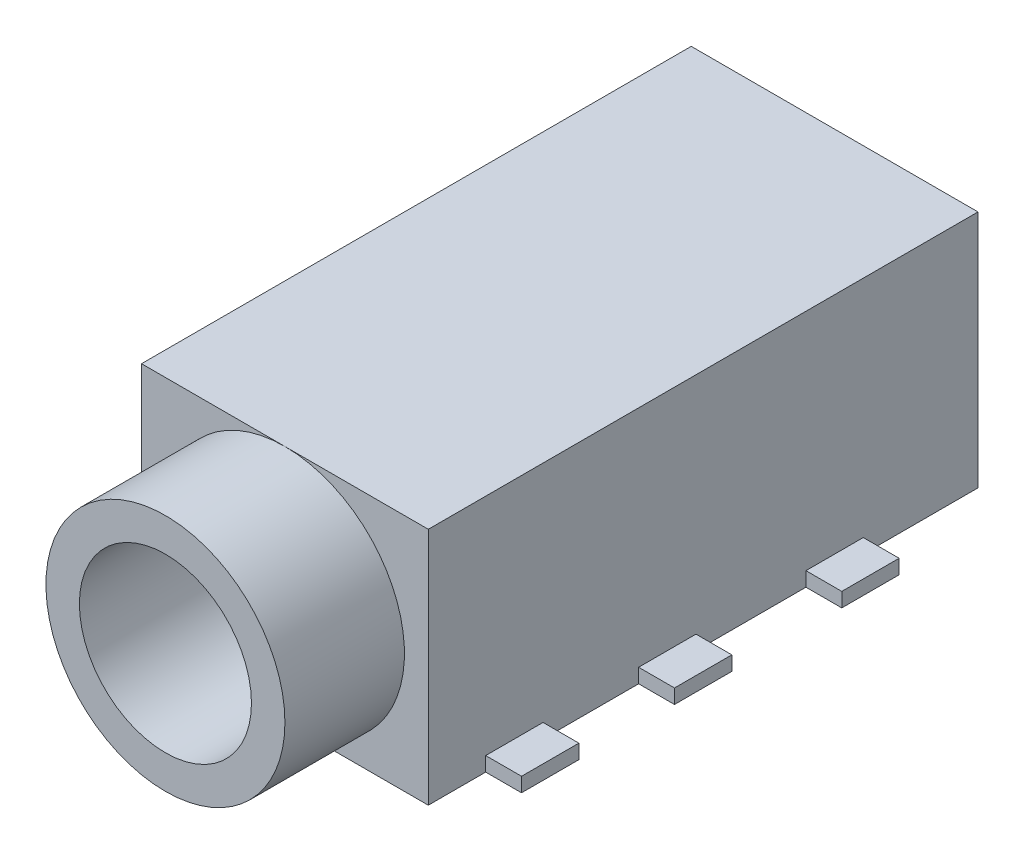
ISO-10303-21;
HEADER;
FILE_DESCRIPTION(('STEP AP214'),'2;1');
FILE_NAME('part.step','',(''),(''),'','','');
FILE_SCHEMA(('AUTOMOTIVE_DESIGN { 1 0 10303 214 1 1 1 1 }'));
ENDSEC;
DATA;
#1=APPLICATION_CONTEXT('core data for automotive mechanical design processes');
#2=APPLICATION_PROTOCOL_DEFINITION('international standard','automotive_design',2000,#1);
#3=PRODUCT_CONTEXT('',#1,'mechanical');
#4=PRODUCT('Part','Part','',(#3));
#5=PRODUCT_RELATED_PRODUCT_CATEGORY('part','',(#4));
#6=PRODUCT_DEFINITION_FORMATION('','',#4);
#7=PRODUCT_DEFINITION_CONTEXT('part definition',#1,'design');
#8=PRODUCT_DEFINITION('design','',#6,#7);
#9=PRODUCT_DEFINITION_SHAPE('','',#8);
#10=(LENGTH_UNIT() NAMED_UNIT(*) SI_UNIT(.MILLI.,.METRE.));
#11=(NAMED_UNIT(*) PLANE_ANGLE_UNIT() SI_UNIT($,.RADIAN.));
#12=(NAMED_UNIT(*) SI_UNIT($,.STERADIAN.) SOLID_ANGLE_UNIT());
#13=UNCERTAINTY_MEASURE_WITH_UNIT(LENGTH_MEASURE(1.E-05),#10,'distance_accuracy_value','');
#14=(GEOMETRIC_REPRESENTATION_CONTEXT(3) GLOBAL_UNCERTAINTY_ASSIGNED_CONTEXT((#13)) GLOBAL_UNIT_ASSIGNED_CONTEXT((#10,
#11,#12)) REPRESENTATION_CONTEXT('',''));
#15=CARTESIAN_POINT('',(0.,0.,0.));
#16=DIRECTION('',(0.,0.,1.));
#17=DIRECTION('',(1.,0.,0.));
#18=AXIS2_PLACEMENT_3D('',#15,#16,#17);
#19=CARTESIAN_POINT('',(-3.,2.5,11.5));
#20=DIRECTION('',(1.,0.,0.));
#21=DIRECTION('',(0.,0.,-1.));
#22=AXIS2_PLACEMENT_3D('',#19,#20,#21);
#23=PLANE('',#22);
#24=DIRECTION('',(0.,0.,1.));
#25=VECTOR('',#24,1.);
#26=CARTESIAN_POINT('',(-3.,-2.2,10.3));
#27=LINE('',#26,#25);
#28=CARTESIAN_POINT('',(-3.,-2.2,9.1));
#29=VERTEX_POINT('',#28);
#30=CARTESIAN_POINT('',(-3.,-2.2,10.3));
#31=VERTEX_POINT('',#30);
#32=EDGE_CURVE('E251',#29,#31,#27,.T.);
#33=ORIENTED_EDGE('',*,*,#32,.T.);
#34=DIRECTION('',(0.,-1.,0.));
#35=VECTOR('',#34,1.);
#36=CARTESIAN_POINT('',(-3.,-2.2,10.3));
#37=LINE('',#36,#35);
#38=CARTESIAN_POINT('',(-3.,-2.5,10.3));
#39=VERTEX_POINT('',#38);
#40=EDGE_CURVE('E265',#31,#39,#37,.T.);
#41=ORIENTED_EDGE('',*,*,#40,.T.);
#42=DIRECTION('',(0.,0.,-1.));
#43=VECTOR('',#42,1.);
#44=CARTESIAN_POINT('',(-3.,-2.5,11.5));
#45=LINE('',#44,#43);
#46=CARTESIAN_POINT('',(-3.,-2.5,11.5));
#47=VERTEX_POINT('',#46);
#48=EDGE_CURVE('E545',#47,#39,#45,.T.);
#49=ORIENTED_EDGE('',*,*,#48,.F.);
#50=DIRECTION('',(0.,-1.,0.));
#51=VECTOR('',#50,1.);
#52=CARTESIAN_POINT('',(-3.,2.5,11.5));
#53=LINE('',#52,#51);
#54=CARTESIAN_POINT('',(-3.,2.5,11.5));
#55=VERTEX_POINT('',#54);
#56=EDGE_CURVE('E517',#55,#47,#53,.T.);
#57=ORIENTED_EDGE('',*,*,#56,.F.);
#58=DIRECTION('',(0.,0.,-1.));
#59=VECTOR('',#58,1.);
#60=CARTESIAN_POINT('',(-3.,2.5,11.5));
#61=LINE('',#60,#59);
#62=CARTESIAN_POINT('',(-3.,2.5,0.));
#63=VERTEX_POINT('',#62);
#64=EDGE_CURVE('E549',#55,#63,#61,.T.);
#65=ORIENTED_EDGE('',*,*,#64,.T.);
#66=DIRECTION('',(0.,-1.,0.));
#67=VECTOR('',#66,1.);
#68=CARTESIAN_POINT('',(-3.,2.5,0.));
#69=LINE('',#68,#67);
#70=CARTESIAN_POINT('',(-3.,-2.5,0.));
#71=VERTEX_POINT('',#70);
#72=EDGE_CURVE('E532',#63,#71,#69,.T.);
#73=ORIENTED_EDGE('',*,*,#72,.T.);
#74=CARTESIAN_POINT('',(-3.,-2.5,2.40000000000001));
#75=VERTEX_POINT('',#74);
#76=EDGE_CURVE('E543',#75,#71,#45,.T.);
#77=ORIENTED_EDGE('',*,*,#76,.F.);
#78=DIRECTION('',(0.,-1.,0.));
#79=VECTOR('',#78,1.);
#80=CARTESIAN_POINT('',(-3.,-2.2,2.40000000000001));
#81=LINE('',#80,#79);
#82=CARTESIAN_POINT('',(-3.,-2.2,2.40000000000001));
#83=VERTEX_POINT('',#82);
#84=EDGE_CURVE('E361',#83,#75,#81,.T.);
#85=ORIENTED_EDGE('',*,*,#84,.F.);
#86=DIRECTION('',(0.,0.,1.));
#87=VECTOR('',#86,1.);
#88=CARTESIAN_POINT('',(-3.,-2.2,3.6));
#89=LINE('',#88,#87);
#90=CARTESIAN_POINT('',(-3.,-2.2,3.6));
#91=VERTEX_POINT('',#90);
#92=EDGE_CURVE('E341',#83,#91,#89,.T.);
#93=ORIENTED_EDGE('',*,*,#92,.T.);
#94=DIRECTION('',(0.,-1.,0.));
#95=VECTOR('',#94,1.);
#96=CARTESIAN_POINT('',(-3.,-2.2,3.6));
#97=LINE('',#96,#95);
#98=CARTESIAN_POINT('',(-3.,-2.5,3.60000000000001));
#99=VERTEX_POINT('',#98);
#100=EDGE_CURVE('E356',#91,#99,#97,.T.);
#101=ORIENTED_EDGE('',*,*,#100,.T.);
#102=CARTESIAN_POINT('',(-3.,-2.5,5.9));
#103=VERTEX_POINT('',#102);
#104=EDGE_CURVE('E622',#103,#99,#45,.T.);
#105=ORIENTED_EDGE('',*,*,#104,.F.);
#106=DIRECTION('',(0.,-1.,0.));
#107=VECTOR('',#106,1.);
#108=CARTESIAN_POINT('',(-3.,-2.2,5.9));
#109=LINE('',#108,#107);
#110=CARTESIAN_POINT('',(-3.,-2.2,5.9));
#111=VERTEX_POINT('',#110);
#112=EDGE_CURVE('E321',#111,#103,#109,.T.);
#113=ORIENTED_EDGE('',*,*,#112,.F.);
#114=DIRECTION('',(0.,0.,1.));
#115=VECTOR('',#114,1.);
#116=CARTESIAN_POINT('',(-3.,-2.2,7.1));
#117=LINE('',#116,#115);
#118=CARTESIAN_POINT('',(-3.,-2.2,7.1));
#119=VERTEX_POINT('',#118);
#120=EDGE_CURVE('E303',#111,#119,#117,.T.);
#121=ORIENTED_EDGE('',*,*,#120,.T.);
#122=DIRECTION('',(0.,-1.,0.));
#123=VECTOR('',#122,1.);
#124=CARTESIAN_POINT('',(-3.,-2.2,7.1));
#125=LINE('',#124,#123);
#126=CARTESIAN_POINT('',(-3.,-2.5,7.1));
#127=VERTEX_POINT('',#126);
#128=EDGE_CURVE('E316',#119,#127,#125,.T.);
#129=ORIENTED_EDGE('',*,*,#128,.T.);
#130=CARTESIAN_POINT('',(-3.,-2.5,9.1));
#131=VERTEX_POINT('',#130);
#132=EDGE_CURVE('E550',#131,#127,#45,.T.);
#133=ORIENTED_EDGE('',*,*,#132,.F.);
#134=DIRECTION('',(0.,-1.,0.));
#135=VECTOR('',#134,1.);
#136=CARTESIAN_POINT('',(-3.,-2.2,9.1));
#137=LINE('',#136,#135);
#138=EDGE_CURVE('E288',#29,#131,#137,.T.);
#139=ORIENTED_EDGE('',*,*,#138,.F.);
#140=EDGE_LOOP('',(#33,#41,#49,#57,#65,#73,#77,#85,#93,#101,#105,#113,#121,#129,#133,#139));
#141=FACE_BOUND('',#140,.T.);
#142=ADVANCED_FACE('F48',(#141),#23,.F.);
#143=CARTESIAN_POINT('',(3.,2.5,11.5));
#144=DIRECTION('',(-1.,0.,0.));
#145=DIRECTION('',(0.,-1.,0.));
#146=AXIS2_PLACEMENT_3D('',#143,#144,#145);
#147=PLANE('',#146);
#148=DIRECTION('',(0.,0.,-1.));
#149=VECTOR('',#148,1.);
#150=CARTESIAN_POINT('',(3.,-2.5,11.5));
#151=LINE('',#150,#149);
#152=CARTESIAN_POINT('',(3.,-2.5,5.9));
#153=VERTEX_POINT('',#152);
#154=CARTESIAN_POINT('',(3.,-2.5,3.6));
#155=VERTEX_POINT('',#154);
#156=EDGE_CURVE('E1048',#153,#155,#151,.T.);
#157=ORIENTED_EDGE('',*,*,#156,.T.);
#158=DIRECTION('',(0.,-1.,0.));
#159=VECTOR('',#158,1.);
#160=CARTESIAN_POINT('',(3.,-2.2,3.6));
#161=LINE('',#160,#159);
#162=CARTESIAN_POINT('',(3.,-2.2,3.6));
#163=VERTEX_POINT('',#162);
#164=EDGE_CURVE('E396',#163,#155,#161,.T.);
#165=ORIENTED_EDGE('',*,*,#164,.F.);
#166=DIRECTION('',(0.,0.,-1.));
#167=VECTOR('',#166,1.);
#168=CARTESIAN_POINT('',(3.,-2.2,3.6));
#169=LINE('',#168,#167);
#170=CARTESIAN_POINT('',(3.,-2.2,2.4));
#171=VERTEX_POINT('',#170);
#172=EDGE_CURVE('E369',#163,#171,#169,.T.);
#173=ORIENTED_EDGE('',*,*,#172,.T.);
#174=DIRECTION('',(0.,-1.,0.));
#175=VECTOR('',#174,1.);
#176=CARTESIAN_POINT('',(3.,-2.2,2.4));
#177=LINE('',#176,#175);
#178=CARTESIAN_POINT('',(3.,-2.5,2.4));
#179=VERTEX_POINT('',#178);
#180=EDGE_CURVE('E385',#171,#179,#177,.T.);
#181=ORIENTED_EDGE('',*,*,#180,.T.);
#182=CARTESIAN_POINT('',(3.,-2.5,0.));
#183=VERTEX_POINT('',#182);
#184=EDGE_CURVE('E525',#179,#183,#151,.T.);
#185=ORIENTED_EDGE('',*,*,#184,.T.);
#186=DIRECTION('',(0.,1.,0.));
#187=VECTOR('',#186,1.);
#188=CARTESIAN_POINT('',(3.,2.5,0.));
#189=LINE('',#188,#187);
#190=CARTESIAN_POINT('',(3.,2.5,0.));
#191=VERTEX_POINT('',#190);
#192=EDGE_CURVE('E503',#183,#191,#189,.T.);
#193=ORIENTED_EDGE('',*,*,#192,.T.);
#194=DIRECTION('',(0.,0.,-1.));
#195=VECTOR('',#194,1.);
#196=CARTESIAN_POINT('',(3.,2.5,11.5));
#197=LINE('',#196,#195);
#198=CARTESIAN_POINT('',(3.,2.5,11.5));
#199=VERTEX_POINT('',#198);
#200=EDGE_CURVE('E554',#199,#191,#197,.T.);
#201=ORIENTED_EDGE('',*,*,#200,.F.);
#202=DIRECTION('',(0.,1.,0.));
#203=VECTOR('',#202,1.);
#204=CARTESIAN_POINT('',(3.,2.5,11.5));
#205=LINE('',#204,#203);
#206=CARTESIAN_POINT('',(3.,-2.5,11.5));
#207=VERTEX_POINT('',#206);
#208=EDGE_CURVE('E508',#207,#199,#205,.T.);
#209=ORIENTED_EDGE('',*,*,#208,.F.);
#210=CARTESIAN_POINT('',(3.,-2.5,10.3));
#211=VERTEX_POINT('',#210);
#212=EDGE_CURVE('E539',#207,#211,#151,.T.);
#213=ORIENTED_EDGE('',*,*,#212,.T.);
#214=DIRECTION('',(0.,-1.,0.));
#215=VECTOR('',#214,1.);
#216=CARTESIAN_POINT('',(3.,-2.2,10.3));
#217=LINE('',#216,#215);
#218=CARTESIAN_POINT('',(3.,-2.2,10.3));
#219=VERTEX_POINT('',#218);
#220=EDGE_CURVE('E478',#219,#211,#217,.T.);
#221=ORIENTED_EDGE('',*,*,#220,.F.);
#222=DIRECTION('',(0.,0.,-1.));
#223=VECTOR('',#222,1.);
#224=CARTESIAN_POINT('',(3.,-2.2,10.3));
#225=LINE('',#224,#223);
#226=CARTESIAN_POINT('',(3.,-2.2,9.1));
#227=VERTEX_POINT('',#226);
#228=EDGE_CURVE('E450',#219,#227,#225,.T.);
#229=ORIENTED_EDGE('',*,*,#228,.T.);
#230=DIRECTION('',(0.,-1.,0.));
#231=VECTOR('',#230,1.);
#232=CARTESIAN_POINT('',(3.,-2.2,9.1));
#233=LINE('',#232,#231);
#234=CARTESIAN_POINT('',(3.,-2.5,9.1));
#235=VERTEX_POINT('',#234);
#236=EDGE_CURVE('E467',#227,#235,#233,.T.);
#237=ORIENTED_EDGE('',*,*,#236,.T.);
#238=CARTESIAN_POINT('',(3.,-2.5,7.1));
#239=VERTEX_POINT('',#238);
#240=EDGE_CURVE('E544',#235,#239,#151,.T.);
#241=ORIENTED_EDGE('',*,*,#240,.T.);
#242=DIRECTION('',(0.,-1.,0.));
#243=VECTOR('',#242,1.);
#244=CARTESIAN_POINT('',(3.,-2.2,7.1));
#245=LINE('',#244,#243);
#246=CARTESIAN_POINT('',(3.,-2.2,7.1));
#247=VERTEX_POINT('',#246);
#248=EDGE_CURVE('E436',#247,#239,#245,.T.);
#249=ORIENTED_EDGE('',*,*,#248,.F.);
#250=DIRECTION('',(0.,0.,-1.));
#251=VECTOR('',#250,1.);
#252=CARTESIAN_POINT('',(3.,-2.2,7.1));
#253=LINE('',#252,#251);
#254=CARTESIAN_POINT('',(3.,-2.2,5.9));
#255=VERTEX_POINT('',#254);
#256=EDGE_CURVE('E409',#247,#255,#253,.T.);
#257=ORIENTED_EDGE('',*,*,#256,.T.);
#258=DIRECTION('',(0.,-1.,0.));
#259=VECTOR('',#258,1.);
#260=CARTESIAN_POINT('',(3.,-2.2,5.9));
#261=LINE('',#260,#259);
#262=EDGE_CURVE('E425',#255,#153,#261,.T.);
#263=ORIENTED_EDGE('',*,*,#262,.T.);
#264=EDGE_LOOP('',(#157,#165,#173,#181,#185,#193,#201,#209,#213,#221,#229,#237,#241,#249,#257,#263));
#265=FACE_BOUND('',#264,.T.);
#266=ADVANCED_FACE('F50',(#265),#147,.F.);
#267=CARTESIAN_POINT('',(0.,0.,11.5));
#268=DIRECTION('',(0.,0.,1.));
#269=DIRECTION('',(1.,0.,0.));
#270=AXIS2_PLACEMENT_3D('',#267,#268,#269);
#271=PLANE('',#270);
#272=CARTESIAN_POINT('',(0.,0.,11.5));
#273=DIRECTION('',(0.,0.,1.));
#274=DIRECTION('',(1.,0.,0.));
#275=AXIS2_PLACEMENT_3D('',#272,#273,#274);
#276=CIRCLE('',#275,2.5);
#277=CARTESIAN_POINT('',(0.,2.5,11.5));
#278=VERTEX_POINT('',#277);
#279=CARTESIAN_POINT('',(0.,-2.5,11.5));
#280=VERTEX_POINT('',#279);
#281=EDGE_CURVE('E498',#278,#280,#276,.T.);
#282=ORIENTED_EDGE('',*,*,#281,.F.);
#283=DIRECTION('',(-1.,0.,0.));
#284=VECTOR('',#283,1.);
#285=CARTESIAN_POINT('',(-3.,2.5,11.5));
#286=LINE('',#285,#284);
#287=EDGE_CURVE('E512',#278,#55,#286,.T.);
#288=ORIENTED_EDGE('',*,*,#287,.T.);
#289=ORIENTED_EDGE('',*,*,#56,.T.);
#290=DIRECTION('',(1.,0.,0.));
#291=VECTOR('',#290,1.);
#292=CARTESIAN_POINT('',(-3.,-2.5,11.5));
#293=LINE('',#292,#291);
#294=EDGE_CURVE('E521',#47,#280,#293,.T.);
#295=ORIENTED_EDGE('',*,*,#294,.T.);
#296=EDGE_LOOP('',(#282,#288,#289,#295));
#297=FACE_BOUND('',#296,.T.);
#298=ADVANCED_FACE('F576',(#297),#271,.T.);
#299=CARTESIAN_POINT('',(-3.,2.5,11.5));
#300=DIRECTION('',(0.,-1.,0.));
#301=DIRECTION('',(0.,0.,-1.));
#302=AXIS2_PLACEMENT_3D('',#299,#300,#301);
#303=PLANE('',#302);
#304=DIRECTION('',(-1.,0.,0.));
#305=VECTOR('',#304,1.);
#306=CARTESIAN_POINT('',(-3.,2.5,0.));
#307=LINE('',#306,#305);
#308=EDGE_CURVE('E529',#191,#63,#307,.T.);
#309=ORIENTED_EDGE('',*,*,#308,.T.);
#310=ORIENTED_EDGE('',*,*,#64,.F.);
#311=ORIENTED_EDGE('',*,*,#287,.F.);
#312=EDGE_CURVE('E514',#199,#278,#286,.T.);
#313=ORIENTED_EDGE('',*,*,#312,.F.);
#314=ORIENTED_EDGE('',*,*,#200,.T.);
#315=EDGE_LOOP('',(#309,#310,#311,#313,#314));
#316=FACE_BOUND('',#315,.T.);
#317=ADVANCED_FACE('F603',(#316),#303,.F.);
#318=CARTESIAN_POINT('',(-3.,-2.5,11.5));
#319=DIRECTION('',(0.,1.,0.));
#320=DIRECTION('',(0.,0.,1.));
#321=AXIS2_PLACEMENT_3D('',#318,#319,#320);
#322=PLANE('',#321);
#323=CARTESIAN_POINT('',(0.,-2.5,3.));
#324=DIRECTION('',(0.,1.,0.));
#325=DIRECTION('',(0.,0.,1.));
#326=AXIS2_PLACEMENT_3D('',#323,#324,#325);
#327=CIRCLE('',#326,0.750000000000001);
#328=CARTESIAN_POINT('',(0.,-2.5,3.75));
#329=VERTEX_POINT('',#328);
#330=EDGE_CURVE('E13',#329,#329,#327,.F.);
#331=ORIENTED_EDGE('',*,*,#330,.F.);
#332=EDGE_LOOP('',(#331));
#333=FACE_BOUND('',#332,.T.);
#334=CARTESIAN_POINT('',(0.,-2.5,9.));
#335=DIRECTION('',(0.,1.,0.));
#336=DIRECTION('',(0.,0.,1.));
#337=AXIS2_PLACEMENT_3D('',#334,#335,#336);
#338=CIRCLE('',#337,0.75);
#339=CARTESIAN_POINT('',(0.,-2.5,9.75));
#340=VERTEX_POINT('',#339);
#341=EDGE_CURVE('E57',#340,#340,#338,.F.);
#342=ORIENTED_EDGE('',*,*,#341,.F.);
#343=EDGE_LOOP('',(#342));
#344=FACE_BOUND('',#343,.T.);
#345=DIRECTION('',(1.,0.,0.));
#346=VECTOR('',#345,1.);
#347=CARTESIAN_POINT('',(-3.,-2.5,0.));
#348=LINE('',#347,#346);
#349=EDGE_CURVE('E513',#71,#183,#348,.T.);
#350=ORIENTED_EDGE('',*,*,#349,.T.);
#351=ORIENTED_EDGE('',*,*,#184,.F.);
#352=DIRECTION('',(1.,0.,0.));
#353=VECTOR('',#352,1.);
#354=CARTESIAN_POINT('',(3.,-2.5,2.4));
#355=LINE('',#354,#353);
#356=CARTESIAN_POINT('',(3.75,-2.5,2.4));
#357=VERTEX_POINT('',#356);
#358=EDGE_CURVE('E360',#179,#357,#355,.T.);
#359=ORIENTED_EDGE('',*,*,#358,.T.);
#360=DIRECTION('',(0.,0.,1.));
#361=VECTOR('',#360,1.);
#362=CARTESIAN_POINT('',(3.75,-2.5,3.6));
#363=LINE('',#362,#361);
#364=CARTESIAN_POINT('',(3.75,-2.5,3.6));
#365=VERTEX_POINT('',#364);
#366=EDGE_CURVE('E389',#357,#365,#363,.T.);
#367=ORIENTED_EDGE('',*,*,#366,.T.);
#368=DIRECTION('',(-1.,0.,0.));
#369=VECTOR('',#368,1.);
#370=CARTESIAN_POINT('',(3.,-2.5,3.6));
#371=LINE('',#370,#369);
#372=EDGE_CURVE('E373',#365,#155,#371,.T.);
#373=ORIENTED_EDGE('',*,*,#372,.T.);
#374=ORIENTED_EDGE('',*,*,#156,.F.);
#375=DIRECTION('',(1.,0.,0.));
#376=VECTOR('',#375,1.);
#377=CARTESIAN_POINT('',(3.,-2.5,5.9));
#378=LINE('',#377,#376);
#379=CARTESIAN_POINT('',(3.75,-2.5,5.9));
#380=VERTEX_POINT('',#379);
#381=EDGE_CURVE('E399',#153,#380,#378,.T.);
#382=ORIENTED_EDGE('',*,*,#381,.T.);
#383=DIRECTION('',(0.,0.,1.));
#384=VECTOR('',#383,1.);
#385=CARTESIAN_POINT('',(3.75,-2.5,7.1));
#386=LINE('',#385,#384);
#387=CARTESIAN_POINT('',(3.75,-2.5,7.1));
#388=VERTEX_POINT('',#387);
#389=EDGE_CURVE('E429',#380,#388,#386,.T.);
#390=ORIENTED_EDGE('',*,*,#389,.T.);
#391=DIRECTION('',(-1.,0.,0.));
#392=VECTOR('',#391,1.);
#393=CARTESIAN_POINT('',(3.,-2.5,7.1));
#394=LINE('',#393,#392);
#395=EDGE_CURVE('E413',#388,#239,#394,.T.);
#396=ORIENTED_EDGE('',*,*,#395,.T.);
#397=ORIENTED_EDGE('',*,*,#240,.F.);
#398=DIRECTION('',(1.,0.,0.));
#399=VECTOR('',#398,1.);
#400=CARTESIAN_POINT('',(3.,-2.5,9.1));
#401=LINE('',#400,#399);
#402=CARTESIAN_POINT('',(3.75,-2.5,9.1));
#403=VERTEX_POINT('',#402);
#404=EDGE_CURVE('E440',#235,#403,#401,.T.);
#405=ORIENTED_EDGE('',*,*,#404,.T.);
#406=DIRECTION('',(0.,0.,1.));
#407=VECTOR('',#406,1.);
#408=CARTESIAN_POINT('',(3.75,-2.5,10.3));
#409=LINE('',#408,#407);
#410=CARTESIAN_POINT('',(3.75,-2.5,10.3));
#411=VERTEX_POINT('',#410);
#412=EDGE_CURVE('E471',#403,#411,#409,.T.);
#413=ORIENTED_EDGE('',*,*,#412,.T.);
#414=DIRECTION('',(-1.,0.,0.));
#415=VECTOR('',#414,1.);
#416=CARTESIAN_POINT('',(3.,-2.5,10.3));
#417=LINE('',#416,#415);
#418=EDGE_CURVE('E455',#411,#211,#417,.T.);
#419=ORIENTED_EDGE('',*,*,#418,.T.);
#420=ORIENTED_EDGE('',*,*,#212,.F.);
#421=EDGE_CURVE('E520',#280,#207,#293,.T.);
#422=ORIENTED_EDGE('',*,*,#421,.F.);
#423=ORIENTED_EDGE('',*,*,#294,.F.);
#424=ORIENTED_EDGE('',*,*,#48,.T.);
#425=DIRECTION('',(-1.,0.,0.));
#426=VECTOR('',#425,1.);
#427=CARTESIAN_POINT('',(-3.,-2.5,10.3));
#428=LINE('',#427,#426);
#429=CARTESIAN_POINT('',(-3.75,-2.5,10.3));
#430=VERTEX_POINT('',#429);
#431=EDGE_CURVE('E280',#39,#430,#428,.T.);
#432=ORIENTED_EDGE('',*,*,#431,.T.);
#433=DIRECTION('',(0.,0.,-1.));
#434=VECTOR('',#433,1.);
#435=CARTESIAN_POINT('',(-3.75,-2.5,10.3));
#436=LINE('',#435,#434);
#437=CARTESIAN_POINT('',(-3.75,-2.5,9.1));
#438=VERTEX_POINT('',#437);
#439=EDGE_CURVE('E245',#430,#438,#436,.T.);
#440=ORIENTED_EDGE('',*,*,#439,.T.);
#441=DIRECTION('',(1.,0.,0.));
#442=VECTOR('',#441,1.);
#443=CARTESIAN_POINT('',(-3.,-2.5,9.1));
#444=LINE('',#443,#442);
#445=EDGE_CURVE('E64',#438,#131,#444,.T.);
#446=ORIENTED_EDGE('',*,*,#445,.T.);
#447=ORIENTED_EDGE('',*,*,#132,.T.);
#448=DIRECTION('',(-1.,0.,0.));
#449=VECTOR('',#448,1.);
#450=CARTESIAN_POINT('',(-3.,-2.5,7.1));
#451=LINE('',#450,#449);
#452=CARTESIAN_POINT('',(-3.75,-2.5,7.1));
#453=VERTEX_POINT('',#452);
#454=EDGE_CURVE('E287',#127,#453,#451,.T.);
#455=ORIENTED_EDGE('',*,*,#454,.T.);
#456=DIRECTION('',(0.,0.,-1.));
#457=VECTOR('',#456,1.);
#458=CARTESIAN_POINT('',(-3.75,-2.5,7.1));
#459=LINE('',#458,#457);
#460=CARTESIAN_POINT('',(-3.75,-2.5,5.9));
#461=VERTEX_POINT('',#460);
#462=EDGE_CURVE('E311',#453,#461,#459,.T.);
#463=ORIENTED_EDGE('',*,*,#462,.T.);
#464=DIRECTION('',(1.,0.,0.));
#465=VECTOR('',#464,1.);
#466=CARTESIAN_POINT('',(-3.,-2.5,5.9));
#467=LINE('',#466,#465);
#468=EDGE_CURVE('E71',#461,#103,#467,.T.);
#469=ORIENTED_EDGE('',*,*,#468,.T.);
#470=ORIENTED_EDGE('',*,*,#104,.T.);
#471=DIRECTION('',(-1.,0.,0.));
#472=VECTOR('',#471,1.);
#473=CARTESIAN_POINT('',(-3.,-2.5,3.6));
#474=LINE('',#473,#472);
#475=CARTESIAN_POINT('',(-3.75,-2.5,3.6));
#476=VERTEX_POINT('',#475);
#477=EDGE_CURVE('E320',#99,#476,#474,.T.);
#478=ORIENTED_EDGE('',*,*,#477,.T.);
#479=DIRECTION('',(0.,0.,-1.));
#480=VECTOR('',#479,1.);
#481=CARTESIAN_POINT('',(-3.75,-2.5,3.6));
#482=LINE('',#481,#480);
#483=CARTESIAN_POINT('',(-3.74999999999999,-2.5,2.4));
#484=VERTEX_POINT('',#483);
#485=EDGE_CURVE('E349',#476,#484,#482,.T.);
#486=ORIENTED_EDGE('',*,*,#485,.T.);
#487=DIRECTION('',(1.,0.,0.));
#488=VECTOR('',#487,1.);
#489=CARTESIAN_POINT('',(-3.,-2.5,2.40000000000001));
#490=LINE('',#489,#488);
#491=EDGE_CURVE('E334',#484,#75,#490,.T.);
#492=ORIENTED_EDGE('',*,*,#491,.T.);
#493=ORIENTED_EDGE('',*,*,#76,.T.);
#494=EDGE_LOOP('',(#350,#351,#359,#367,#373,#374,#382,#390,#396,#397,#405,#413,#419,#420,#422,
#423,#424,#432,#440,#446,#447,#455,#463,#469,#470,#478,#486,#492,#493));
#495=FACE_BOUND('',#494,.T.);
#496=ADVANCED_FACE('F572',(#333,#344,#495),#322,.F.);
#497=EDGE_CURVE('E507',#280,#278,#276,.T.);
#498=ORIENTED_EDGE('',*,*,#497,.F.);
#499=ORIENTED_EDGE('',*,*,#421,.T.);
#500=ORIENTED_EDGE('',*,*,#208,.T.);
#501=ORIENTED_EDGE('',*,*,#312,.T.);
#502=EDGE_LOOP('',(#498,#499,#500,#501));
#503=FACE_BOUND('',#502,.T.);
#504=ADVANCED_FACE('F568',(#503),#271,.T.);
#505=CARTESIAN_POINT('',(0.,0.,0.));
#506=DIRECTION('',(0.,0.,1.));
#507=DIRECTION('',(1.,0.,0.));
#508=AXIS2_PLACEMENT_3D('',#505,#506,#507);
#509=PLANE('',#508);
#510=ORIENTED_EDGE('',*,*,#192,.F.);
#511=ORIENTED_EDGE('',*,*,#349,.F.);
#512=ORIENTED_EDGE('',*,*,#72,.F.);
#513=ORIENTED_EDGE('',*,*,#308,.F.);
#514=EDGE_LOOP('',(#510,#511,#512,#513));
#515=FACE_BOUND('',#514,.T.);
#516=ADVANCED_FACE('F618',(#515),#509,.F.);
#517=CARTESIAN_POINT('',(0.,0.,14.));
#518=DIRECTION('',(0.,0.,1.));
#519=DIRECTION('',(1.,0.,0.));
#520=AXIS2_PLACEMENT_3D('',#517,#518,#519);
#521=PLANE('',#520);
#522=CARTESIAN_POINT('',(0.,0.,14.));
#523=DIRECTION('',(0.,0.,1.));
#524=DIRECTION('',(1.,0.,0.));
#525=AXIS2_PLACEMENT_3D('',#522,#523,#524);
#526=CIRCLE('',#525,2.5);
#527=CARTESIAN_POINT('',(2.5,0.,14.));
#528=VERTEX_POINT('',#527);
#529=EDGE_CURVE('E499',#528,#528,#526,.T.);
#530=ORIENTED_EDGE('',*,*,#529,.T.);
#531=EDGE_LOOP('',(#530));
#532=FACE_BOUND('',#531,.T.);
#533=CARTESIAN_POINT('',(0.,0.,14.));
#534=DIRECTION('',(0.,0.,1.));
#535=DIRECTION('',(1.,0.,0.));
#536=AXIS2_PLACEMENT_3D('',#533,#534,#535);
#537=CIRCLE('',#536,1.8);
#538=CARTESIAN_POINT('',(1.8,0.,14.));
#539=VERTEX_POINT('',#538);
#540=EDGE_CURVE('E494',#539,#539,#537,.T.);
#541=ORIENTED_EDGE('',*,*,#540,.F.);
#542=EDGE_LOOP('',(#541));
#543=FACE_BOUND('',#542,.T.);
#544=ADVANCED_FACE('F722',(#532,#543),#521,.T.);
#545=CARTESIAN_POINT('',(0.,0.,14.));
#546=DIRECTION('',(0.,0.,-1.));
#547=DIRECTION('',(-1.,0.,0.));
#548=AXIS2_PLACEMENT_3D('',#545,#546,#547);
#549=CYLINDRICAL_SURFACE('',#548,2.5);
#550=ORIENTED_EDGE('',*,*,#529,.F.);
#551=EDGE_LOOP('',(#550));
#552=FACE_BOUND('',#551,.T.);
#553=ORIENTED_EDGE('',*,*,#281,.T.);
#554=ORIENTED_EDGE('',*,*,#497,.T.);
#555=EDGE_LOOP('',(#553,#554));
#556=FACE_BOUND('',#555,.T.);
#557=ADVANCED_FACE('F564',(#552,#556),#549,.T.);
#558=CARTESIAN_POINT('',(0.,0.,14.));
#559=DIRECTION('',(0.,0.,-1.));
#560=DIRECTION('',(-1.,0.,0.));
#561=AXIS2_PLACEMENT_3D('',#558,#559,#560);
#562=CYLINDRICAL_SURFACE('',#561,1.8);
#563=ORIENTED_EDGE('',*,*,#540,.T.);
#564=EDGE_LOOP('',(#563));
#565=FACE_BOUND('',#564,.T.);
#566=CARTESIAN_POINT('',(0.,0.,1.5));
#567=DIRECTION('',(0.,0.,1.));
#568=DIRECTION('',(1.,0.,0.));
#569=AXIS2_PLACEMENT_3D('',#566,#567,#568);
#570=CIRCLE('',#569,1.8);
#571=CARTESIAN_POINT('',(1.8,0.,1.5));
#572=VERTEX_POINT('',#571);
#573=EDGE_CURVE('E481',#572,#572,#570,.T.);
#574=ORIENTED_EDGE('',*,*,#573,.F.);
#575=EDGE_LOOP('',(#574));
#576=FACE_BOUND('',#575,.T.);
#577=ADVANCED_FACE('F717',(#565,#576),#562,.F.);
#578=CARTESIAN_POINT('',(0.,0.,1.5));
#579=DIRECTION('',(0.,0.,1.));
#580=DIRECTION('',(1.,0.,0.));
#581=AXIS2_PLACEMENT_3D('',#578,#579,#580);
#582=PLANE('',#581);
#583=ORIENTED_EDGE('',*,*,#573,.T.);
#584=EDGE_LOOP('',(#583));
#585=FACE_BOUND('',#584,.T.);
#586=ADVANCED_FACE('F707',(#585),#582,.T.);
#587=CARTESIAN_POINT('',(3.,-2.2,10.3));
#588=DIRECTION('',(0.,0.,1.));
#589=DIRECTION('',(1.,0.,0.));
#590=AXIS2_PLACEMENT_3D('',#587,#588,#589);
#591=PLANE('',#590);
#592=ORIENTED_EDGE('',*,*,#418,.F.);
#593=DIRECTION('',(0.,-1.,0.));
#594=VECTOR('',#593,1.);
#595=CARTESIAN_POINT('',(3.75,-2.2,10.3));
#596=LINE('',#595,#594);
#597=CARTESIAN_POINT('',(3.75,-2.2,10.3));
#598=VERTEX_POINT('',#597);
#599=EDGE_CURVE('E482',#598,#411,#596,.T.);
#600=ORIENTED_EDGE('',*,*,#599,.F.);
#601=DIRECTION('',(-1.,0.,0.));
#602=VECTOR('',#601,1.);
#603=CARTESIAN_POINT('',(3.,-2.2,10.3));
#604=LINE('',#603,#602);
#605=EDGE_CURVE('E463',#598,#219,#604,.T.);
#606=ORIENTED_EDGE('',*,*,#605,.T.);
#607=ORIENTED_EDGE('',*,*,#220,.T.);
#608=EDGE_LOOP('',(#592,#600,#606,#607));
#609=FACE_BOUND('',#608,.T.);
#610=ADVANCED_FACE('F703',(#609),#591,.T.);
#611=CARTESIAN_POINT('',(3.75,-2.2,10.3));
#612=DIRECTION('',(1.,0.,0.));
#613=DIRECTION('',(0.,0.,-1.));
#614=AXIS2_PLACEMENT_3D('',#611,#612,#613);
#615=PLANE('',#614);
#616=ORIENTED_EDGE('',*,*,#412,.F.);
#617=DIRECTION('',(0.,-1.,0.));
#618=VECTOR('',#617,1.);
#619=CARTESIAN_POINT('',(3.75,-2.2,9.1));
#620=LINE('',#619,#618);
#621=CARTESIAN_POINT('',(3.75,-2.2,9.1));
#622=VERTEX_POINT('',#621);
#623=EDGE_CURVE('E485',#622,#403,#620,.T.);
#624=ORIENTED_EDGE('',*,*,#623,.F.);
#625=DIRECTION('',(0.,0.,1.));
#626=VECTOR('',#625,1.);
#627=CARTESIAN_POINT('',(3.75,-2.2,10.3));
#628=LINE('',#627,#626);
#629=EDGE_CURVE('E459',#622,#598,#628,.T.);
#630=ORIENTED_EDGE('',*,*,#629,.T.);
#631=ORIENTED_EDGE('',*,*,#599,.T.);
#632=EDGE_LOOP('',(#616,#624,#630,#631));
#633=FACE_BOUND('',#632,.T.);
#634=ADVANCED_FACE('F706',(#633),#615,.T.);
#635=CARTESIAN_POINT('',(3.,-2.2,9.1));
#636=DIRECTION('',(0.,0.,-1.));
#637=DIRECTION('',(-1.,0.,0.));
#638=AXIS2_PLACEMENT_3D('',#635,#636,#637);
#639=PLANE('',#638);
#640=ORIENTED_EDGE('',*,*,#404,.F.);
#641=ORIENTED_EDGE('',*,*,#236,.F.);
#642=DIRECTION('',(1.,0.,0.));
#643=VECTOR('',#642,1.);
#644=CARTESIAN_POINT('',(3.,-2.2,9.1));
#645=LINE('',#644,#643);
#646=EDGE_CURVE('E454',#227,#622,#645,.T.);
#647=ORIENTED_EDGE('',*,*,#646,.T.);
#648=ORIENTED_EDGE('',*,*,#623,.T.);
#649=EDGE_LOOP('',(#640,#641,#647,#648));
#650=FACE_BOUND('',#649,.T.);
#651=ADVANCED_FACE('F701',(#650),#639,.T.);
#652=CARTESIAN_POINT('',(0.,-2.2,0.));
#653=DIRECTION('',(0.,-1.,0.));
#654=DIRECTION('',(0.,0.,-1.));
#655=AXIS2_PLACEMENT_3D('',#652,#653,#654);
#656=PLANE('',#655);
#657=ORIENTED_EDGE('',*,*,#228,.F.);
#658=ORIENTED_EDGE('',*,*,#605,.F.);
#659=ORIENTED_EDGE('',*,*,#629,.F.);
#660=ORIENTED_EDGE('',*,*,#646,.F.);
#661=EDGE_LOOP('',(#657,#658,#659,#660));
#662=FACE_BOUND('',#661,.T.);
#663=ADVANCED_FACE('F691',(#662),#656,.F.);
#664=CARTESIAN_POINT('',(3.,-2.2,7.1));
#665=DIRECTION('',(0.,0.,1.));
#666=DIRECTION('',(1.,0.,0.));
#667=AXIS2_PLACEMENT_3D('',#664,#665,#666);
#668=PLANE('',#667);
#669=ORIENTED_EDGE('',*,*,#395,.F.);
#670=DIRECTION('',(0.,-1.,0.));
#671=VECTOR('',#670,1.);
#672=CARTESIAN_POINT('',(3.75,-2.2,7.1));
#673=LINE('',#672,#671);
#674=CARTESIAN_POINT('',(3.75,-2.2,7.1));
#675=VERTEX_POINT('',#674);
#676=EDGE_CURVE('E441',#675,#388,#673,.T.);
#677=ORIENTED_EDGE('',*,*,#676,.F.);
#678=DIRECTION('',(-1.,0.,0.));
#679=VECTOR('',#678,1.);
#680=CARTESIAN_POINT('',(3.,-2.2,7.1));
#681=LINE('',#680,#679);
#682=EDGE_CURVE('E421',#675,#247,#681,.T.);
#683=ORIENTED_EDGE('',*,*,#682,.T.);
#684=ORIENTED_EDGE('',*,*,#248,.T.);
#685=EDGE_LOOP('',(#669,#677,#683,#684));
#686=FACE_BOUND('',#685,.T.);
#687=ADVANCED_FACE('F687',(#686),#668,.T.);
#688=CARTESIAN_POINT('',(3.75,-2.2,7.1));
#689=DIRECTION('',(1.,0.,0.));
#690=DIRECTION('',(0.,0.,-1.));
#691=AXIS2_PLACEMENT_3D('',#688,#689,#690);
#692=PLANE('',#691);
#693=ORIENTED_EDGE('',*,*,#389,.F.);
#694=DIRECTION('',(0.,-1.,0.));
#695=VECTOR('',#694,1.);
#696=CARTESIAN_POINT('',(3.75,-2.2,5.9));
#697=LINE('',#696,#695);
#698=CARTESIAN_POINT('',(3.75,-2.2,5.9));
#699=VERTEX_POINT('',#698);
#700=EDGE_CURVE('E444',#699,#380,#697,.T.);
#701=ORIENTED_EDGE('',*,*,#700,.F.);
#702=DIRECTION('',(0.,0.,1.));
#703=VECTOR('',#702,1.);
#704=CARTESIAN_POINT('',(3.75,-2.2,7.1));
#705=LINE('',#704,#703);
#706=EDGE_CURVE('E417',#699,#675,#705,.T.);
#707=ORIENTED_EDGE('',*,*,#706,.T.);
#708=ORIENTED_EDGE('',*,*,#676,.T.);
#709=EDGE_LOOP('',(#693,#701,#707,#708));
#710=FACE_BOUND('',#709,.T.);
#711=ADVANCED_FACE('F690',(#710),#692,.T.);
#712=CARTESIAN_POINT('',(3.,-2.2,5.9));
#713=DIRECTION('',(0.,0.,-1.));
#714=DIRECTION('',(-1.,0.,0.));
#715=AXIS2_PLACEMENT_3D('',#712,#713,#714);
#716=PLANE('',#715);
#717=ORIENTED_EDGE('',*,*,#381,.F.);
#718=ORIENTED_EDGE('',*,*,#262,.F.);
#719=DIRECTION('',(1.,0.,0.));
#720=VECTOR('',#719,1.);
#721=CARTESIAN_POINT('',(3.,-2.2,5.9));
#722=LINE('',#721,#720);
#723=EDGE_CURVE('E412',#255,#699,#722,.T.);
#724=ORIENTED_EDGE('',*,*,#723,.T.);
#725=ORIENTED_EDGE('',*,*,#700,.T.);
#726=EDGE_LOOP('',(#717,#718,#724,#725));
#727=FACE_BOUND('',#726,.T.);
#728=ADVANCED_FACE('F685',(#727),#716,.T.);
#729=CARTESIAN_POINT('',(0.,-2.2,0.));
#730=DIRECTION('',(0.,-1.,0.));
#731=DIRECTION('',(0.,0.,-1.));
#732=AXIS2_PLACEMENT_3D('',#729,#730,#731);
#733=PLANE('',#732);
#734=ORIENTED_EDGE('',*,*,#256,.F.);
#735=ORIENTED_EDGE('',*,*,#682,.F.);
#736=ORIENTED_EDGE('',*,*,#706,.F.);
#737=ORIENTED_EDGE('',*,*,#723,.F.);
#738=EDGE_LOOP('',(#734,#735,#736,#737));
#739=FACE_BOUND('',#738,.T.);
#740=ADVANCED_FACE('F675',(#739),#733,.F.);
#741=CARTESIAN_POINT('',(3.,-2.2,3.6));
#742=DIRECTION('',(0.,0.,1.));
#743=DIRECTION('',(1.,0.,0.));
#744=AXIS2_PLACEMENT_3D('',#741,#742,#743);
#745=PLANE('',#744);
#746=ORIENTED_EDGE('',*,*,#372,.F.);
#747=DIRECTION('',(0.,-1.,0.));
#748=VECTOR('',#747,1.);
#749=CARTESIAN_POINT('',(3.75,-2.2,3.6));
#750=LINE('',#749,#748);
#751=CARTESIAN_POINT('',(3.75,-2.2,3.6));
#752=VERTEX_POINT('',#751);
#753=EDGE_CURVE('E400',#752,#365,#750,.T.);
#754=ORIENTED_EDGE('',*,*,#753,.F.);
#755=DIRECTION('',(-1.,0.,0.));
#756=VECTOR('',#755,1.);
#757=CARTESIAN_POINT('',(3.,-2.2,3.6));
#758=LINE('',#757,#756);
#759=EDGE_CURVE('E381',#752,#163,#758,.T.);
#760=ORIENTED_EDGE('',*,*,#759,.T.);
#761=ORIENTED_EDGE('',*,*,#164,.T.);
#762=EDGE_LOOP('',(#746,#754,#760,#761));
#763=FACE_BOUND('',#762,.T.);
#764=ADVANCED_FACE('F671',(#763),#745,.T.);
#765=CARTESIAN_POINT('',(3.75,-2.2,3.6));
#766=DIRECTION('',(1.,0.,0.));
#767=DIRECTION('',(0.,0.,-1.));
#768=AXIS2_PLACEMENT_3D('',#765,#766,#767);
#769=PLANE('',#768);
#770=ORIENTED_EDGE('',*,*,#366,.F.);
#771=DIRECTION('',(0.,-1.,0.));
#772=VECTOR('',#771,1.);
#773=CARTESIAN_POINT('',(3.75,-2.2,2.4));
#774=LINE('',#773,#772);
#775=CARTESIAN_POINT('',(3.75,-2.2,2.4));
#776=VERTEX_POINT('',#775);
#777=EDGE_CURVE('E403',#776,#357,#774,.T.);
#778=ORIENTED_EDGE('',*,*,#777,.F.);
#779=DIRECTION('',(0.,0.,1.));
#780=VECTOR('',#779,1.);
#781=CARTESIAN_POINT('',(3.75,-2.2,3.6));
#782=LINE('',#781,#780);
#783=EDGE_CURVE('E377',#776,#752,#782,.T.);
#784=ORIENTED_EDGE('',*,*,#783,.T.);
#785=ORIENTED_EDGE('',*,*,#753,.T.);
#786=EDGE_LOOP('',(#770,#778,#784,#785));
#787=FACE_BOUND('',#786,.T.);
#788=ADVANCED_FACE('F674',(#787),#769,.T.);
#789=CARTESIAN_POINT('',(3.,-2.2,2.4));
#790=DIRECTION('',(0.,0.,-1.));
#791=DIRECTION('',(-1.,0.,0.));
#792=AXIS2_PLACEMENT_3D('',#789,#790,#791);
#793=PLANE('',#792);
#794=ORIENTED_EDGE('',*,*,#358,.F.);
#795=ORIENTED_EDGE('',*,*,#180,.F.);
#796=DIRECTION('',(1.,0.,0.));
#797=VECTOR('',#796,1.);
#798=CARTESIAN_POINT('',(3.,-2.2,2.4));
#799=LINE('',#798,#797);
#800=EDGE_CURVE('E372',#171,#776,#799,.T.);
#801=ORIENTED_EDGE('',*,*,#800,.T.);
#802=ORIENTED_EDGE('',*,*,#777,.T.);
#803=EDGE_LOOP('',(#794,#795,#801,#802));
#804=FACE_BOUND('',#803,.T.);
#805=ADVANCED_FACE('F669',(#804),#793,.T.);
#806=CARTESIAN_POINT('',(0.,-2.2,0.));
#807=DIRECTION('',(0.,-1.,0.));
#808=DIRECTION('',(0.,0.,-1.));
#809=AXIS2_PLACEMENT_3D('',#806,#807,#808);
#810=PLANE('',#809);
#811=ORIENTED_EDGE('',*,*,#172,.F.);
#812=ORIENTED_EDGE('',*,*,#759,.F.);
#813=ORIENTED_EDGE('',*,*,#783,.F.);
#814=ORIENTED_EDGE('',*,*,#800,.F.);
#815=EDGE_LOOP('',(#811,#812,#813,#814));
#816=FACE_BOUND('',#815,.T.);
#817=ADVANCED_FACE('F662',(#816),#810,.F.);
#818=CARTESIAN_POINT('',(-3.,-2.2,3.6));
#819=DIRECTION('',(0.,0.,1.));
#820=DIRECTION('',(1.,0.,0.));
#821=AXIS2_PLACEMENT_3D('',#818,#819,#820);
#822=PLANE('',#821);
#823=ORIENTED_EDGE('',*,*,#477,.F.);
#824=ORIENTED_EDGE('',*,*,#100,.F.);
#825=DIRECTION('',(-1.,0.,0.));
#826=VECTOR('',#825,1.);
#827=CARTESIAN_POINT('',(-3.,-2.2,3.6));
#828=LINE('',#827,#826);
#829=CARTESIAN_POINT('',(-3.75,-2.2,3.6));
#830=VERTEX_POINT('',#829);
#831=EDGE_CURVE('E329',#91,#830,#828,.T.);
#832=ORIENTED_EDGE('',*,*,#831,.T.);
#833=DIRECTION('',(0.,-1.,0.));
#834=VECTOR('',#833,1.);
#835=CARTESIAN_POINT('',(-3.75,-2.2,3.6));
#836=LINE('',#835,#834);
#837=EDGE_CURVE('E345',#830,#476,#836,.T.);
#838=ORIENTED_EDGE('',*,*,#837,.T.);
#839=EDGE_LOOP('',(#823,#824,#832,#838));
#840=FACE_BOUND('',#839,.T.);
#841=ADVANCED_FACE('F645',(#840),#822,.T.);
#842=CARTESIAN_POINT('',(-3.,-2.2,2.40000000000001));
#843=DIRECTION('',(0.,0.,-1.));
#844=DIRECTION('',(-1.,0.,0.));
#845=AXIS2_PLACEMENT_3D('',#842,#843,#844);
#846=PLANE('',#845);
#847=ORIENTED_EDGE('',*,*,#491,.F.);
#848=DIRECTION('',(0.,-1.,0.));
#849=VECTOR('',#848,1.);
#850=CARTESIAN_POINT('',(-3.74999999999999,-2.2,2.4));
#851=LINE('',#850,#849);
#852=CARTESIAN_POINT('',(-3.74999999999999,-2.2,2.4));
#853=VERTEX_POINT('',#852);
#854=EDGE_CURVE('E364',#853,#484,#851,.T.);
#855=ORIENTED_EDGE('',*,*,#854,.F.);
#856=DIRECTION('',(1.,0.,0.));
#857=VECTOR('',#856,1.);
#858=CARTESIAN_POINT('',(-3.,-2.2,2.40000000000001));
#859=LINE('',#858,#857);
#860=EDGE_CURVE('E338',#853,#83,#859,.T.);
#861=ORIENTED_EDGE('',*,*,#860,.T.);
#862=ORIENTED_EDGE('',*,*,#84,.T.);
#863=EDGE_LOOP('',(#847,#855,#861,#862));
#864=FACE_BOUND('',#863,.T.);
#865=ADVANCED_FACE('F654',(#864),#846,.T.);
#866=CARTESIAN_POINT('',(-3.75,-2.2,3.6));
#867=DIRECTION('',(-1.,0.,0.));
#868=DIRECTION('',(0.,0.,1.));
#869=AXIS2_PLACEMENT_3D('',#866,#867,#868);
#870=PLANE('',#869);
#871=ORIENTED_EDGE('',*,*,#485,.F.);
#872=ORIENTED_EDGE('',*,*,#837,.F.);
#873=DIRECTION('',(0.,0.,-1.));
#874=VECTOR('',#873,1.);
#875=CARTESIAN_POINT('',(-3.75,-2.2,3.6));
#876=LINE('',#875,#874);
#877=EDGE_CURVE('E333',#830,#853,#876,.T.);
#878=ORIENTED_EDGE('',*,*,#877,.T.);
#879=ORIENTED_EDGE('',*,*,#854,.T.);
#880=EDGE_LOOP('',(#871,#872,#878,#879));
#881=FACE_BOUND('',#880,.T.);
#882=ADVANCED_FACE('F652',(#881),#870,.T.);
#883=CARTESIAN_POINT('',(0.,-2.2,0.));
#884=DIRECTION('',(0.,-1.,0.));
#885=DIRECTION('',(0.,0.,-1.));
#886=AXIS2_PLACEMENT_3D('',#883,#884,#885);
#887=PLANE('',#886);
#888=ORIENTED_EDGE('',*,*,#831,.F.);
#889=ORIENTED_EDGE('',*,*,#92,.F.);
#890=ORIENTED_EDGE('',*,*,#860,.F.);
#891=ORIENTED_EDGE('',*,*,#877,.F.);
#892=EDGE_LOOP('',(#888,#889,#890,#891));
#893=FACE_BOUND('',#892,.T.);
#894=ADVANCED_FACE('F648',(#893),#887,.F.);
#895=CARTESIAN_POINT('',(-3.,-2.2,7.1));
#896=DIRECTION('',(0.,0.,1.));
#897=DIRECTION('',(1.,0.,0.));
#898=AXIS2_PLACEMENT_3D('',#895,#896,#897);
#899=PLANE('',#898);
#900=ORIENTED_EDGE('',*,*,#454,.F.);
#901=ORIENTED_EDGE('',*,*,#128,.F.);
#902=DIRECTION('',(-1.,0.,0.));
#903=VECTOR('',#902,1.);
#904=CARTESIAN_POINT('',(-3.,-2.2,7.1));
#905=LINE('',#904,#903);
#906=CARTESIAN_POINT('',(-3.75,-2.2,7.1));
#907=VERTEX_POINT('',#906);
#908=EDGE_CURVE('E293',#119,#907,#905,.T.);
#909=ORIENTED_EDGE('',*,*,#908,.T.);
#910=DIRECTION('',(0.,-1.,0.));
#911=VECTOR('',#910,1.);
#912=CARTESIAN_POINT('',(-3.75,-2.2,7.1));
#913=LINE('',#912,#911);
#914=EDGE_CURVE('E307',#907,#453,#913,.T.);
#915=ORIENTED_EDGE('',*,*,#914,.T.);
#916=EDGE_LOOP('',(#900,#901,#909,#915));
#917=FACE_BOUND('',#916,.T.);
#918=ADVANCED_FACE('F630',(#917),#899,.T.);
#919=CARTESIAN_POINT('',(-3.,-2.2,5.9));
#920=DIRECTION('',(0.,0.,-1.));
#921=DIRECTION('',(-1.,0.,0.));
#922=AXIS2_PLACEMENT_3D('',#919,#920,#921);
#923=PLANE('',#922);
#924=ORIENTED_EDGE('',*,*,#468,.F.);
#925=DIRECTION('',(0.,-1.,0.));
#926=VECTOR('',#925,1.);
#927=CARTESIAN_POINT('',(-3.75,-2.2,5.9));
#928=LINE('',#927,#926);
#929=CARTESIAN_POINT('',(-3.75,-2.2,5.9));
#930=VERTEX_POINT('',#929);
#931=EDGE_CURVE('E324',#930,#461,#928,.T.);
#932=ORIENTED_EDGE('',*,*,#931,.F.);
#933=DIRECTION('',(1.,0.,0.));
#934=VECTOR('',#933,1.);
#935=CARTESIAN_POINT('',(-3.,-2.2,5.9));
#936=LINE('',#935,#934);
#937=EDGE_CURVE('E301',#930,#111,#936,.T.);
#938=ORIENTED_EDGE('',*,*,#937,.T.);
#939=ORIENTED_EDGE('',*,*,#112,.T.);
#940=EDGE_LOOP('',(#924,#932,#938,#939));
#941=FACE_BOUND('',#940,.T.);
#942=ADVANCED_FACE('F641',(#941),#923,.T.);
#943=CARTESIAN_POINT('',(-3.75,-2.2,7.1));
#944=DIRECTION('',(-1.,0.,0.));
#945=DIRECTION('',(0.,0.,1.));
#946=AXIS2_PLACEMENT_3D('',#943,#944,#945);
#947=PLANE('',#946);
#948=ORIENTED_EDGE('',*,*,#462,.F.);
#949=ORIENTED_EDGE('',*,*,#914,.F.);
#950=DIRECTION('',(0.,0.,-1.));
#951=VECTOR('',#950,1.);
#952=CARTESIAN_POINT('',(-3.75,-2.2,7.1));
#953=LINE('',#952,#951);
#954=EDGE_CURVE('E297',#907,#930,#953,.T.);
#955=ORIENTED_EDGE('',*,*,#954,.T.);
#956=ORIENTED_EDGE('',*,*,#931,.T.);
#957=EDGE_LOOP('',(#948,#949,#955,#956));
#958=FACE_BOUND('',#957,.T.);
#959=ADVANCED_FACE('F639',(#958),#947,.T.);
#960=CARTESIAN_POINT('',(0.,-2.2,0.));
#961=DIRECTION('',(0.,-1.,0.));
#962=DIRECTION('',(0.,0.,-1.));
#963=AXIS2_PLACEMENT_3D('',#960,#961,#962);
#964=PLANE('',#963);
#965=ORIENTED_EDGE('',*,*,#908,.F.);
#966=ORIENTED_EDGE('',*,*,#120,.F.);
#967=ORIENTED_EDGE('',*,*,#937,.F.);
#968=ORIENTED_EDGE('',*,*,#954,.F.);
#969=EDGE_LOOP('',(#965,#966,#967,#968));
#970=FACE_BOUND('',#969,.T.);
#971=ADVANCED_FACE('F592',(#970),#964,.F.);
#972=CARTESIAN_POINT('',(-3.,-2.2,10.3));
#973=DIRECTION('',(0.,0.,1.));
#974=DIRECTION('',(1.,0.,0.));
#975=AXIS2_PLACEMENT_3D('',#972,#973,#974);
#976=PLANE('',#975);
#977=ORIENTED_EDGE('',*,*,#431,.F.);
#978=ORIENTED_EDGE('',*,*,#40,.F.);
#979=DIRECTION('',(-1.,0.,0.));
#980=VECTOR('',#979,1.);
#981=CARTESIAN_POINT('',(-3.,-2.2,10.3));
#982=LINE('',#981,#980);
#983=CARTESIAN_POINT('',(-3.75,-2.2,10.3));
#984=VERTEX_POINT('',#983);
#985=EDGE_CURVE('E258',#31,#984,#982,.T.);
#986=ORIENTED_EDGE('',*,*,#985,.T.);
#987=DIRECTION('',(0.,-1.,0.));
#988=VECTOR('',#987,1.);
#989=CARTESIAN_POINT('',(-3.75,-2.2,10.3));
#990=LINE('',#989,#988);
#991=EDGE_CURVE('E241',#984,#430,#990,.T.);
#992=ORIENTED_EDGE('',*,*,#991,.T.);
#993=EDGE_LOOP('',(#977,#978,#986,#992));
#994=FACE_BOUND('',#993,.T.);
#995=ADVANCED_FACE('F263',(#994),#976,.T.);
#996=CARTESIAN_POINT('',(-3.,-2.2,9.1));
#997=DIRECTION('',(0.,0.,-1.));
#998=DIRECTION('',(-1.,0.,0.));
#999=AXIS2_PLACEMENT_3D('',#996,#997,#998);
#1000=PLANE('',#999);
#1001=ORIENTED_EDGE('',*,*,#445,.F.);
#1002=DIRECTION('',(0.,-1.,0.));
#1003=VECTOR('',#1002,1.);
#1004=CARTESIAN_POINT('',(-3.75,-2.2,9.1));
#1005=LINE('',#1004,#1003);
#1006=CARTESIAN_POINT('',(-3.75,-2.2,9.1));
#1007=VERTEX_POINT('',#1006);
#1008=EDGE_CURVE('E250',#1007,#438,#1005,.T.);
#1009=ORIENTED_EDGE('',*,*,#1008,.F.);
#1010=DIRECTION('',(1.,0.,0.));
#1011=VECTOR('',#1010,1.);
#1012=CARTESIAN_POINT('',(-3.,-2.2,9.1));
#1013=LINE('',#1012,#1011);
#1014=EDGE_CURVE('E260',#1007,#29,#1013,.T.);
#1015=ORIENTED_EDGE('',*,*,#1014,.T.);
#1016=ORIENTED_EDGE('',*,*,#138,.T.);
#1017=EDGE_LOOP('',(#1001,#1009,#1015,#1016));
#1018=FACE_BOUND('',#1017,.T.);
#1019=ADVANCED_FACE('F584',(#1018),#1000,.T.);
#1020=CARTESIAN_POINT('',(-3.75,-2.2,10.3));
#1021=DIRECTION('',(-1.,0.,0.));
#1022=DIRECTION('',(0.,0.,1.));
#1023=AXIS2_PLACEMENT_3D('',#1020,#1021,#1022);
#1024=PLANE('',#1023);
#1025=ORIENTED_EDGE('',*,*,#439,.F.);
#1026=ORIENTED_EDGE('',*,*,#991,.F.);
#1027=DIRECTION('',(0.,0.,-1.));
#1028=VECTOR('',#1027,1.);
#1029=CARTESIAN_POINT('',(-3.75,-2.2,10.3));
#1030=LINE('',#1029,#1028);
#1031=EDGE_CURVE('E244',#984,#1007,#1030,.T.);
#1032=ORIENTED_EDGE('',*,*,#1031,.T.);
#1033=ORIENTED_EDGE('',*,*,#1008,.T.);
#1034=EDGE_LOOP('',(#1025,#1026,#1032,#1033));
#1035=FACE_BOUND('',#1034,.T.);
#1036=ADVANCED_FACE('F243',(#1035),#1024,.T.);
#1037=CARTESIAN_POINT('',(0.,-2.2,0.));
#1038=DIRECTION('',(0.,-1.,0.));
#1039=DIRECTION('',(0.,0.,-1.));
#1040=AXIS2_PLACEMENT_3D('',#1037,#1038,#1039);
#1041=PLANE('',#1040);
#1042=ORIENTED_EDGE('',*,*,#985,.F.);
#1043=ORIENTED_EDGE('',*,*,#32,.F.);
#1044=ORIENTED_EDGE('',*,*,#1014,.F.);
#1045=ORIENTED_EDGE('',*,*,#1031,.F.);
#1046=EDGE_LOOP('',(#1042,#1043,#1044,#1045));
#1047=FACE_BOUND('',#1046,.T.);
#1048=ADVANCED_FACE('F256',(#1047),#1041,.F.);
#1049=CARTESIAN_POINT('',(0.,-3.1,9.));
#1050=DIRECTION('',(0.,1.,0.));
#1051=DIRECTION('',(0.,0.,1.));
#1052=AXIS2_PLACEMENT_3D('',#1049,#1050,#1051);
#1053=CYLINDRICAL_SURFACE('',#1052,0.75);
#1054=CARTESIAN_POINT('',(0.,-3.1,9.));
#1055=DIRECTION('',(0.,-1.,0.));
#1056=DIRECTION('',(0.,0.,-1.));
#1057=AXIS2_PLACEMENT_3D('',#1054,#1055,#1056);
#1058=CIRCLE('',#1057,0.75);
#1059=CARTESIAN_POINT('',(0.,-3.1,8.25));
#1060=VERTEX_POINT('',#1059);
#1061=EDGE_CURVE('E273',#1060,#1060,#1058,.T.);
#1062=ORIENTED_EDGE('',*,*,#1061,.F.);
#1063=EDGE_LOOP('',(#1062));
#1064=FACE_BOUND('',#1063,.T.);
#1065=ORIENTED_EDGE('',*,*,#341,.T.);
#1066=EDGE_LOOP('',(#1065));
#1067=FACE_BOUND('',#1066,.T.);
#1068=ADVANCED_FACE('F846',(#1064,#1067),#1053,.T.);
#1069=CARTESIAN_POINT('',(0.,-3.1,9.));
#1070=DIRECTION('',(0.,-1.,0.));
#1071=DIRECTION('',(0.,0.,-1.));
#1072=AXIS2_PLACEMENT_3D('',#1069,#1070,#1071);
#1073=PLANE('',#1072);
#1074=ORIENTED_EDGE('',*,*,#1061,.T.);
#1075=EDGE_LOOP('',(#1074));
#1076=FACE_BOUND('',#1075,.T.);
#1077=ADVANCED_FACE('F854',(#1076),#1073,.T.);
#1078=CARTESIAN_POINT('',(0.,-3.1,3.));
#1079=DIRECTION('',(0.,1.,0.));
#1080=DIRECTION('',(0.,0.,1.));
#1081=AXIS2_PLACEMENT_3D('',#1078,#1079,#1080);
#1082=CYLINDRICAL_SURFACE('',#1081,0.750000000000001);
#1083=CARTESIAN_POINT('',(0.,-3.1,3.));
#1084=DIRECTION('',(0.,-1.,0.));
#1085=DIRECTION('',(0.,0.,-1.));
#1086=AXIS2_PLACEMENT_3D('',#1083,#1084,#1085);
#1087=CIRCLE('',#1086,0.750000000000001);
#1088=CARTESIAN_POINT('',(0.,-3.1,2.25));
#1089=VERTEX_POINT('',#1088);
#1090=EDGE_CURVE('E1043',#1089,#1089,#1087,.T.);
#1091=ORIENTED_EDGE('',*,*,#1090,.F.);
#1092=EDGE_LOOP('',(#1091));
#1093=FACE_BOUND('',#1092,.T.);
#1094=ORIENTED_EDGE('',*,*,#330,.T.);
#1095=EDGE_LOOP('',(#1094));
#1096=FACE_BOUND('',#1095,.T.);
#1097=ADVANCED_FACE('F863',(#1093,#1096),#1082,.T.);
#1098=CARTESIAN_POINT('',(0.,-3.1,3.));
#1099=DIRECTION('',(0.,-1.,0.));
#1100=DIRECTION('',(0.,0.,-1.));
#1101=AXIS2_PLACEMENT_3D('',#1098,#1099,#1100);
#1102=PLANE('',#1101);
#1103=ORIENTED_EDGE('',*,*,#1090,.T.);
#1104=EDGE_LOOP('',(#1103));
#1105=FACE_BOUND('',#1104,.T.);
#1106=ADVANCED_FACE('F872',(#1105),#1102,.T.);
#1107=CLOSED_SHELL('',(#142,#266,#298,#317,#496,#504,#516,#544,#557,#577,#586,#610,#634,#651,
#663,#687,#711,#728,#740,#764,#788,#805,#817,#841,#865,#882,#894,#918,#942,#959,#971,#995,#1019,
#1036,#1048,#1068,#1077,#1097,#1106));
#1108=MANIFOLD_SOLID_BREP('B2',#1107);
#1109=ADVANCED_BREP_SHAPE_REPRESENTATION('',(#18,#1108),#14);
#1110=SHAPE_DEFINITION_REPRESENTATION(#9,#1109);
ENDSEC;
END-ISO-10303-21;
